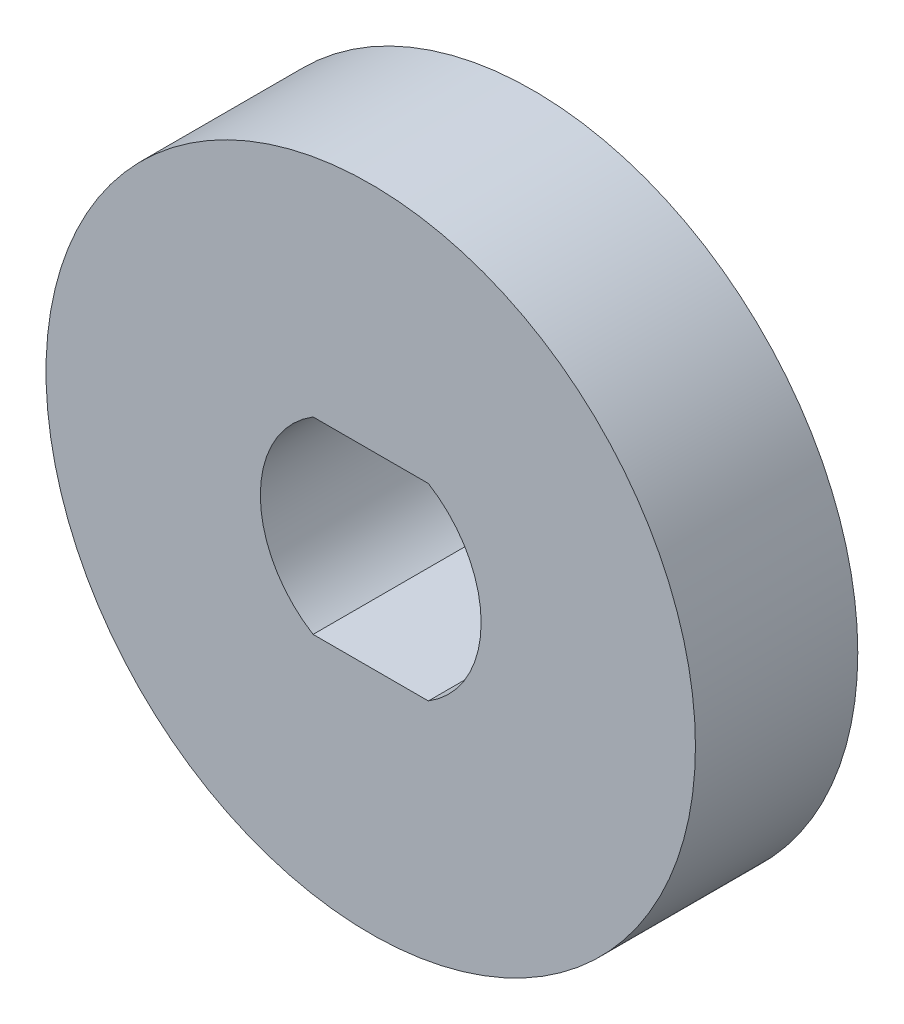
ISO-10303-21;
HEADER;
FILE_DESCRIPTION(('STEP AP214'),'2;1');
FILE_NAME('part.step','',(''),(''),'','','');
FILE_SCHEMA(('AUTOMOTIVE_DESIGN { 1 0 10303 214 1 1 1 1 }'));
ENDSEC;
DATA;
#1=APPLICATION_CONTEXT('core data for automotive mechanical design processes');
#2=APPLICATION_PROTOCOL_DEFINITION('international standard','automotive_design',2000,#1);
#3=PRODUCT_CONTEXT('',#1,'mechanical');
#4=PRODUCT('Part','Part','',(#3));
#5=PRODUCT_RELATED_PRODUCT_CATEGORY('part','',(#4));
#6=PRODUCT_DEFINITION_FORMATION('','',#4);
#7=PRODUCT_DEFINITION_CONTEXT('part definition',#1,'design');
#8=PRODUCT_DEFINITION('design','',#6,#7);
#9=PRODUCT_DEFINITION_SHAPE('','',#8);
#10=(LENGTH_UNIT() NAMED_UNIT(*) SI_UNIT(.MILLI.,.METRE.));
#11=(NAMED_UNIT(*) PLANE_ANGLE_UNIT() SI_UNIT($,.RADIAN.));
#12=(NAMED_UNIT(*) SI_UNIT($,.STERADIAN.) SOLID_ANGLE_UNIT());
#13=UNCERTAINTY_MEASURE_WITH_UNIT(LENGTH_MEASURE(1.E-05),#10,'distance_accuracy_value','');
#14=(GEOMETRIC_REPRESENTATION_CONTEXT(3) GLOBAL_UNCERTAINTY_ASSIGNED_CONTEXT((#13)) GLOBAL_UNIT_ASSIGNED_CONTEXT((#10,
#11,#12)) REPRESENTATION_CONTEXT('',''));
#15=CARTESIAN_POINT('',(0.,0.,0.));
#16=DIRECTION('',(0.,0.,1.));
#17=DIRECTION('',(1.,0.,0.));
#18=AXIS2_PLACEMENT_3D('',#15,#16,#17);
#19=CARTESIAN_POINT('',(0.,0.,5.));
#20=DIRECTION('',(0.,0.,1.));
#21=DIRECTION('',(1.,0.,0.));
#22=AXIS2_PLACEMENT_3D('',#19,#20,#21);
#23=PLANE('',#22);
#24=CARTESIAN_POINT('',(0.,0.,5.));
#25=DIRECTION('',(0.,0.,1.));
#26=DIRECTION('',(1.,0.,0.));
#27=AXIS2_PLACEMENT_3D('',#24,#25,#26);
#28=CIRCLE('',#27,10.);
#29=CARTESIAN_POINT('',(10.,0.,5.));
#30=VERTEX_POINT('',#29);
#31=EDGE_CURVE('E11',#30,#30,#28,.T.);
#32=ORIENTED_EDGE('',*,*,#31,.T.);
#33=EDGE_LOOP('',(#32));
#34=FACE_BOUND('',#33,.T.);
#35=DIRECTION('',(1.,0.,0.));
#36=VECTOR('',#35,1.);
#37=CARTESIAN_POINT('',(-1.77482393492988,-2.9,5.));
#38=LINE('',#37,#36);
#39=CARTESIAN_POINT('',(-1.77482393492988,-2.9,5.));
#40=VERTEX_POINT('',#39);
#41=CARTESIAN_POINT('',(1.77482393492988,-2.9,5.));
#42=VERTEX_POINT('',#41);
#43=EDGE_CURVE('E96',#40,#42,#38,.T.);
#44=ORIENTED_EDGE('',*,*,#43,.F.);
#45=CARTESIAN_POINT('',(0.,0.,5.));
#46=DIRECTION('',(0.,0.,1.));
#47=DIRECTION('',(1.,0.,0.));
#48=AXIS2_PLACEMENT_3D('',#45,#46,#47);
#49=CIRCLE('',#48,3.4);
#50=CARTESIAN_POINT('',(-1.77482393492988,2.9,5.));
#51=VERTEX_POINT('',#50);
#52=EDGE_CURVE('E87',#51,#40,#49,.T.);
#53=ORIENTED_EDGE('',*,*,#52,.F.);
#54=DIRECTION('',(-1.,0.,0.));
#55=VECTOR('',#54,1.);
#56=CARTESIAN_POINT('',(-1.77482393492988,2.9,5.));
#57=LINE('',#56,#55);
#58=CARTESIAN_POINT('',(1.77482393492988,2.9,5.));
#59=VERTEX_POINT('',#58);
#60=EDGE_CURVE('E112',#59,#51,#57,.T.);
#61=ORIENTED_EDGE('',*,*,#60,.F.);
#62=CARTESIAN_POINT('',(0.,0.,5.));
#63=DIRECTION('',(0.,0.,1.));
#64=DIRECTION('',(1.,0.,0.));
#65=AXIS2_PLACEMENT_3D('',#62,#63,#64);
#66=CIRCLE('',#65,3.4);
#67=EDGE_CURVE('E108',#42,#59,#66,.T.);
#68=ORIENTED_EDGE('',*,*,#67,.F.);
#69=EDGE_LOOP('',(#44,#53,#61,#68));
#70=FACE_BOUND('',#69,.T.);
#71=ADVANCED_FACE('F45',(#34,#70),#23,.T.);
#72=CARTESIAN_POINT('',(0.,0.,0.));
#73=DIRECTION('',(0.,0.,1.));
#74=DIRECTION('',(1.,0.,0.));
#75=AXIS2_PLACEMENT_3D('',#72,#73,#74);
#76=PLANE('',#75);
#77=CARTESIAN_POINT('',(0.,0.,0.));
#78=DIRECTION('',(0.,0.,1.));
#79=DIRECTION('',(1.,0.,0.));
#80=AXIS2_PLACEMENT_3D('',#77,#78,#79);
#81=CIRCLE('',#80,10.);
#82=CARTESIAN_POINT('',(10.,0.,0.));
#83=VERTEX_POINT('',#82);
#84=EDGE_CURVE('E49',#83,#83,#81,.T.);
#85=ORIENTED_EDGE('',*,*,#84,.F.);
#86=EDGE_LOOP('',(#85));
#87=FACE_BOUND('',#86,.T.);
#88=CARTESIAN_POINT('',(0.,0.,0.));
#89=DIRECTION('',(0.,0.,1.));
#90=DIRECTION('',(1.,0.,0.));
#91=AXIS2_PLACEMENT_3D('',#88,#89,#90);
#92=CIRCLE('',#91,3.4);
#93=CARTESIAN_POINT('',(-1.77482393492988,2.9,0.));
#94=VERTEX_POINT('',#93);
#95=CARTESIAN_POINT('',(-1.77482393492988,-2.9,0.));
#96=VERTEX_POINT('',#95);
#97=EDGE_CURVE('E69',#94,#96,#92,.T.);
#98=ORIENTED_EDGE('',*,*,#97,.T.);
#99=DIRECTION('',(1.,0.,0.));
#100=VECTOR('',#99,1.);
#101=CARTESIAN_POINT('',(-1.77482393492988,-2.9,0.));
#102=LINE('',#101,#100);
#103=CARTESIAN_POINT('',(1.77482393492988,-2.9,0.));
#104=VERTEX_POINT('',#103);
#105=EDGE_CURVE('E103',#96,#104,#102,.T.);
#106=ORIENTED_EDGE('',*,*,#105,.T.);
#107=CARTESIAN_POINT('',(0.,0.,0.));
#108=DIRECTION('',(0.,0.,1.));
#109=DIRECTION('',(1.,0.,0.));
#110=AXIS2_PLACEMENT_3D('',#107,#108,#109);
#111=CIRCLE('',#110,3.4);
#112=CARTESIAN_POINT('',(1.77482393492988,2.9,0.));
#113=VERTEX_POINT('',#112);
#114=EDGE_CURVE('E121',#104,#113,#111,.T.);
#115=ORIENTED_EDGE('',*,*,#114,.T.);
#116=DIRECTION('',(-1.,0.,0.));
#117=VECTOR('',#116,1.);
#118=CARTESIAN_POINT('',(-1.77482393492988,2.9,0.));
#119=LINE('',#118,#117);
#120=EDGE_CURVE('E97',#113,#94,#119,.T.);
#121=ORIENTED_EDGE('',*,*,#120,.T.);
#122=EDGE_LOOP('',(#98,#106,#115,#121));
#123=FACE_BOUND('',#122,.T.);
#124=ADVANCED_FACE('F137',(#87,#123),#76,.F.);
#125=CARTESIAN_POINT('',(0.,0.,5.));
#126=DIRECTION('',(0.,0.,-1.));
#127=DIRECTION('',(-1.,0.,0.));
#128=AXIS2_PLACEMENT_3D('',#125,#126,#127);
#129=CYLINDRICAL_SURFACE('',#128,10.);
#130=ORIENTED_EDGE('',*,*,#31,.F.);
#131=EDGE_LOOP('',(#130));
#132=FACE_BOUND('',#131,.T.);
#133=ORIENTED_EDGE('',*,*,#84,.T.);
#134=EDGE_LOOP('',(#133));
#135=FACE_BOUND('',#134,.T.);
#136=ADVANCED_FACE('F47',(#132,#135),#129,.T.);
#137=CARTESIAN_POINT('',(0.,0.,5.));
#138=DIRECTION('',(0.,0.,-1.));
#139=DIRECTION('',(-1.,0.,0.));
#140=AXIS2_PLACEMENT_3D('',#137,#138,#139);
#141=CYLINDRICAL_SURFACE('',#140,3.4);
#142=ORIENTED_EDGE('',*,*,#97,.F.);
#143=DIRECTION('',(0.,0.,-1.));
#144=VECTOR('',#143,1.);
#145=CARTESIAN_POINT('',(-1.77482393492988,2.9,5.));
#146=LINE('',#145,#144);
#147=EDGE_CURVE('E91',#51,#94,#146,.T.);
#148=ORIENTED_EDGE('',*,*,#147,.F.);
#149=ORIENTED_EDGE('',*,*,#52,.T.);
#150=DIRECTION('',(0.,0.,-1.));
#151=VECTOR('',#150,1.);
#152=CARTESIAN_POINT('',(-1.77482393492988,-2.9,5.));
#153=LINE('',#152,#151);
#154=EDGE_CURVE('E90',#40,#96,#153,.T.);
#155=ORIENTED_EDGE('',*,*,#154,.T.);
#156=EDGE_LOOP('',(#142,#148,#149,#155));
#157=FACE_BOUND('',#156,.T.);
#158=ADVANCED_FACE('F89',(#157),#141,.F.);
#159=CARTESIAN_POINT('',(-1.77482393492988,-2.9,5.));
#160=DIRECTION('',(0.,1.,0.));
#161=DIRECTION('',(0.,0.,1.));
#162=AXIS2_PLACEMENT_3D('',#159,#160,#161);
#163=PLANE('',#162);
#164=ORIENTED_EDGE('',*,*,#105,.F.);
#165=ORIENTED_EDGE('',*,*,#154,.F.);
#166=ORIENTED_EDGE('',*,*,#43,.T.);
#167=DIRECTION('',(0.,0.,-1.));
#168=VECTOR('',#167,1.);
#169=CARTESIAN_POINT('',(1.77482393492988,-2.9,5.));
#170=LINE('',#169,#168);
#171=EDGE_CURVE('E105',#42,#104,#170,.T.);
#172=ORIENTED_EDGE('',*,*,#171,.T.);
#173=EDGE_LOOP('',(#164,#165,#166,#172));
#174=FACE_BOUND('',#173,.T.);
#175=ADVANCED_FACE('F100',(#174),#163,.T.);
#176=CARTESIAN_POINT('',(0.,0.,5.));
#177=DIRECTION('',(0.,0.,-1.));
#178=DIRECTION('',(-1.,0.,0.));
#179=AXIS2_PLACEMENT_3D('',#176,#177,#178);
#180=CYLINDRICAL_SURFACE('',#179,3.4);
#181=ORIENTED_EDGE('',*,*,#114,.F.);
#182=ORIENTED_EDGE('',*,*,#171,.F.);
#183=ORIENTED_EDGE('',*,*,#67,.T.);
#184=DIRECTION('',(0.,0.,-1.));
#185=VECTOR('',#184,1.);
#186=CARTESIAN_POINT('',(1.77482393492988,2.9,5.));
#187=LINE('',#186,#185);
#188=EDGE_CURVE('E61',#59,#113,#187,.T.);
#189=ORIENTED_EDGE('',*,*,#188,.T.);
#190=EDGE_LOOP('',(#181,#182,#183,#189));
#191=FACE_BOUND('',#190,.T.);
#192=ADVANCED_FACE('F135',(#191),#180,.F.);
#193=CARTESIAN_POINT('',(-1.77482393492988,2.9,5.));
#194=DIRECTION('',(0.,-1.,0.));
#195=DIRECTION('',(0.,0.,-1.));
#196=AXIS2_PLACEMENT_3D('',#193,#194,#195);
#197=PLANE('',#196);
#198=ORIENTED_EDGE('',*,*,#120,.F.);
#199=ORIENTED_EDGE('',*,*,#188,.F.);
#200=ORIENTED_EDGE('',*,*,#60,.T.);
#201=ORIENTED_EDGE('',*,*,#147,.T.);
#202=EDGE_LOOP('',(#198,#199,#200,#201));
#203=FACE_BOUND('',#202,.T.);
#204=ADVANCED_FACE('F138',(#203),#197,.T.);
#205=CLOSED_SHELL('',(#71,#124,#136,#158,#175,#192,#204));
#206=MANIFOLD_SOLID_BREP('B2',#205);
#207=ADVANCED_BREP_SHAPE_REPRESENTATION('',(#18,#206),#14);
#208=SHAPE_DEFINITION_REPRESENTATION(#9,#207);
ENDSEC;
END-ISO-10303-21;
